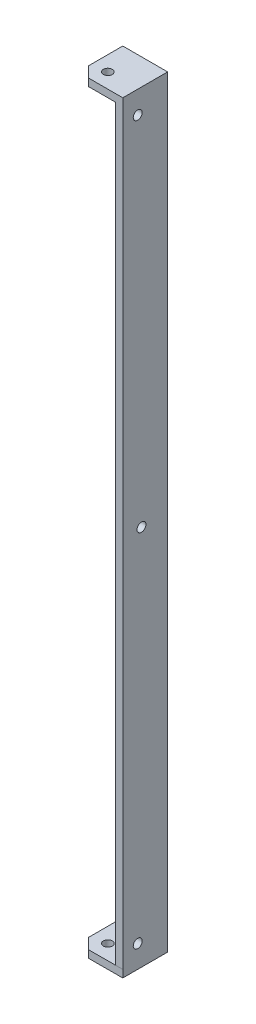
ISO-10303-21;
HEADER;
FILE_DESCRIPTION(('STEP AP214'),'2;1');
FILE_NAME('part.step','',(''),(''),'','','');
FILE_SCHEMA(('AUTOMOTIVE_DESIGN { 1 0 10303 214 1 1 1 1 }'));
ENDSEC;
DATA;
#1=APPLICATION_CONTEXT('core data for automotive mechanical design processes');
#2=APPLICATION_PROTOCOL_DEFINITION('international standard','automotive_design',2000,#1);
#3=PRODUCT_CONTEXT('',#1,'mechanical');
#4=PRODUCT('Part','Part','',(#3));
#5=PRODUCT_RELATED_PRODUCT_CATEGORY('part','',(#4));
#6=PRODUCT_DEFINITION_FORMATION('','',#4);
#7=PRODUCT_DEFINITION_CONTEXT('part definition',#1,'design');
#8=PRODUCT_DEFINITION('design','',#6,#7);
#9=PRODUCT_DEFINITION_SHAPE('','',#8);
#10=(LENGTH_UNIT() NAMED_UNIT(*) SI_UNIT(.MILLI.,.METRE.));
#11=(NAMED_UNIT(*) PLANE_ANGLE_UNIT() SI_UNIT($,.RADIAN.));
#12=(NAMED_UNIT(*) SI_UNIT($,.STERADIAN.) SOLID_ANGLE_UNIT());
#13=UNCERTAINTY_MEASURE_WITH_UNIT(LENGTH_MEASURE(1.E-05),#10,'distance_accuracy_value','');
#14=(GEOMETRIC_REPRESENTATION_CONTEXT(3) GLOBAL_UNCERTAINTY_ASSIGNED_CONTEXT((#13)) GLOBAL_UNIT_ASSIGNED_CONTEXT((#10,
#11,#12)) REPRESENTATION_CONTEXT('',''));
#15=CARTESIAN_POINT('',(0.,0.,0.));
#16=DIRECTION('',(0.,0.,1.));
#17=DIRECTION('',(1.,0.,0.));
#18=AXIS2_PLACEMENT_3D('',#15,#16,#17);
#19=CARTESIAN_POINT('',(0.,0.,5.));
#20=DIRECTION('',(0.,0.,-1.));
#21=DIRECTION('',(-1.,0.,0.));
#22=AXIS2_PLACEMENT_3D('',#19,#20,#21);
#23=PLANE('',#22);
#24=DIRECTION('',(0.,1.,0.));
#25=VECTOR('',#24,1.);
#26=CARTESIAN_POINT('',(12.5,-250.,5.));
#27=LINE('',#26,#25);
#28=CARTESIAN_POINT('',(12.5,-250.,5.));
#29=VERTEX_POINT('',#28);
#30=CARTESIAN_POINT('',(12.5,250.,5.));
#31=VERTEX_POINT('',#30);
#32=EDGE_CURVE('E225',#29,#31,#27,.T.);
#33=ORIENTED_EDGE('',*,*,#32,.T.);
#34=DIRECTION('',(-1.,0.,0.));
#35=VECTOR('',#34,1.);
#36=CARTESIAN_POINT('',(-12.5,250.,5.));
#37=LINE('',#36,#35);
#38=CARTESIAN_POINT('',(-12.5000000000001,250.,5.));
#39=VERTEX_POINT('',#38);
#40=EDGE_CURVE('E52',#31,#39,#37,.T.);
#41=ORIENTED_EDGE('',*,*,#40,.T.);
#42=DIRECTION('',(0.,-1.,0.));
#43=VECTOR('',#42,1.);
#44=CARTESIAN_POINT('',(-12.5,-250.,5.));
#45=LINE('',#44,#43);
#46=CARTESIAN_POINT('',(-12.5,-250.,5.00000000000001));
#47=VERTEX_POINT('',#46);
#48=EDGE_CURVE('E44',#39,#47,#45,.T.);
#49=ORIENTED_EDGE('',*,*,#48,.T.);
#50=DIRECTION('',(1.,0.,0.));
#51=VECTOR('',#50,1.);
#52=CARTESIAN_POINT('',(-12.5,-250.,5.));
#53=LINE('',#52,#51);
#54=EDGE_CURVE('E11',#47,#29,#53,.T.);
#55=ORIENTED_EDGE('',*,*,#54,.T.);
#56=EDGE_LOOP('',(#33,#41,#49,#55));
#57=FACE_BOUND('',#56,.T.);
#58=CARTESIAN_POINT('',(-2.5,240.,5.));
#59=DIRECTION('',(0.,0.,1.));
#60=DIRECTION('',(1.,0.,0.));
#61=AXIS2_PLACEMENT_3D('',#58,#59,#60);
#62=CIRCLE('',#61,3.);
#63=CARTESIAN_POINT('',(0.500000000000001,240.,5.));
#64=VERTEX_POINT('',#63);
#65=EDGE_CURVE('E219',#64,#64,#62,.T.);
#66=ORIENTED_EDGE('',*,*,#65,.F.);
#67=EDGE_LOOP('',(#66));
#68=FACE_BOUND('',#67,.T.);
#69=CARTESIAN_POINT('',(-2.5,-240.,5.));
#70=DIRECTION('',(0.,0.,1.));
#71=DIRECTION('',(1.,0.,0.));
#72=AXIS2_PLACEMENT_3D('',#69,#70,#71);
#73=CIRCLE('',#72,3.);
#74=CARTESIAN_POINT('',(0.500000000000001,-240.,5.));
#75=VERTEX_POINT('',#74);
#76=EDGE_CURVE('E213',#75,#75,#73,.T.);
#77=ORIENTED_EDGE('',*,*,#76,.F.);
#78=EDGE_LOOP('',(#77));
#79=FACE_BOUND('',#78,.T.);
#80=CARTESIAN_POINT('',(0.,0.,5.));
#81=DIRECTION('',(0.,0.,1.));
#82=DIRECTION('',(1.,0.,0.));
#83=AXIS2_PLACEMENT_3D('',#80,#81,#82);
#84=CIRCLE('',#83,3.);
#85=CARTESIAN_POINT('',(3.,0.,5.));
#86=VERTEX_POINT('',#85);
#87=EDGE_CURVE('E207',#86,#86,#84,.T.);
#88=ORIENTED_EDGE('',*,*,#87,.F.);
#89=EDGE_LOOP('',(#88));
#90=FACE_BOUND('',#89,.T.);
#91=ADVANCED_FACE('F35',(#57,#68,#79,#90),#23,.F.);
#92=CARTESIAN_POINT('',(0.,0.,0.));
#93=DIRECTION('',(0.,0.,-1.));
#94=DIRECTION('',(-1.,0.,0.));
#95=AXIS2_PLACEMENT_3D('',#92,#93,#94);
#96=PLANE('',#95);
#97=CARTESIAN_POINT('',(-2.5,-240.,0.));
#98=DIRECTION('',(0.,0.,1.));
#99=DIRECTION('',(1.,0.,0.));
#100=AXIS2_PLACEMENT_3D('',#97,#98,#99);
#101=CIRCLE('',#100,3.);
#102=CARTESIAN_POINT('',(0.500000000000001,-240.,0.));
#103=VERTEX_POINT('',#102);
#104=EDGE_CURVE('E210',#103,#103,#101,.T.);
#105=ORIENTED_EDGE('',*,*,#104,.T.);
#106=EDGE_LOOP('',(#105));
#107=FACE_BOUND('',#106,.T.);
#108=DIRECTION('',(0.,-1.,0.));
#109=VECTOR('',#108,1.);
#110=CARTESIAN_POINT('',(-12.5,-250.,0.));
#111=LINE('',#110,#109);
#112=CARTESIAN_POINT('',(-12.5,255.,0.));
#113=VERTEX_POINT('',#112);
#114=CARTESIAN_POINT('',(-12.5,-255.,0.));
#115=VERTEX_POINT('',#114);
#116=EDGE_CURVE('E222',#113,#115,#111,.T.);
#117=ORIENTED_EDGE('',*,*,#116,.F.);
#118=DIRECTION('',(-1.,0.,0.));
#119=VECTOR('',#118,1.);
#120=CARTESIAN_POINT('',(-12.5,255.,0.));
#121=LINE('',#120,#119);
#122=CARTESIAN_POINT('',(17.5,255.,0.));
#123=VERTEX_POINT('',#122);
#124=EDGE_CURVE('E166',#123,#113,#121,.T.);
#125=ORIENTED_EDGE('',*,*,#124,.F.);
#126=DIRECTION('',(0.,-1.,0.));
#127=VECTOR('',#126,1.);
#128=CARTESIAN_POINT('',(17.5,250.,0.));
#129=LINE('',#128,#127);
#130=CARTESIAN_POINT('',(17.5,-255.,0.));
#131=VERTEX_POINT('',#130);
#132=EDGE_CURVE('E197',#123,#131,#129,.T.);
#133=ORIENTED_EDGE('',*,*,#132,.T.);
#134=DIRECTION('',(1.,0.,0.));
#135=VECTOR('',#134,1.);
#136=CARTESIAN_POINT('',(-12.5,-255.,0.));
#137=LINE('',#136,#135);
#138=EDGE_CURVE('E262',#115,#131,#137,.T.);
#139=ORIENTED_EDGE('',*,*,#138,.F.);
#140=EDGE_LOOP('',(#117,#125,#133,#139));
#141=FACE_BOUND('',#140,.T.);
#142=CARTESIAN_POINT('',(-2.5,240.,0.));
#143=DIRECTION('',(0.,0.,1.));
#144=DIRECTION('',(1.,0.,0.));
#145=AXIS2_PLACEMENT_3D('',#142,#143,#144);
#146=CIRCLE('',#145,3.);
#147=CARTESIAN_POINT('',(0.500000000000001,240.,0.));
#148=VERTEX_POINT('',#147);
#149=EDGE_CURVE('E216',#148,#148,#146,.T.);
#150=ORIENTED_EDGE('',*,*,#149,.T.);
#151=EDGE_LOOP('',(#150));
#152=FACE_BOUND('',#151,.T.);
#153=CARTESIAN_POINT('',(0.,0.,0.));
#154=DIRECTION('',(0.,0.,1.));
#155=DIRECTION('',(1.,0.,0.));
#156=AXIS2_PLACEMENT_3D('',#153,#154,#155);
#157=CIRCLE('',#156,3.);
#158=CARTESIAN_POINT('',(3.,0.,0.));
#159=VERTEX_POINT('',#158);
#160=EDGE_CURVE('E205',#159,#159,#157,.T.);
#161=ORIENTED_EDGE('',*,*,#160,.T.);
#162=EDGE_LOOP('',(#161));
#163=FACE_BOUND('',#162,.T.);
#164=ADVANCED_FACE('F260',(#107,#141,#152,#163),#96,.T.);
#165=CARTESIAN_POINT('',(-12.5,-250.,5.));
#166=DIRECTION('',(1.,0.,0.));
#167=DIRECTION('',(0.,0.,-1.));
#168=AXIS2_PLACEMENT_3D('',#165,#166,#167);
#169=PLANE('',#168);
#170=ORIENTED_EDGE('',*,*,#116,.T.);
#171=DIRECTION('',(0.,0.,-1.));
#172=VECTOR('',#171,1.);
#173=CARTESIAN_POINT('',(-12.5,-255.,22.9563784697419));
#174=LINE('',#173,#172);
#175=CARTESIAN_POINT('',(-12.5,-255.,22.9563784697419));
#176=VERTEX_POINT('',#175);
#177=EDGE_CURVE('E128',#176,#115,#174,.T.);
#178=ORIENTED_EDGE('',*,*,#177,.F.);
#179=DIRECTION('',(0.,1.,0.));
#180=VECTOR('',#179,1.);
#181=CARTESIAN_POINT('',(-12.5,-255.,22.9563784697419));
#182=LINE('',#181,#180);
#183=CARTESIAN_POINT('',(-12.5,-250.,22.9563784697419));
#184=VERTEX_POINT('',#183);
#185=EDGE_CURVE('E124',#176,#184,#182,.T.);
#186=ORIENTED_EDGE('',*,*,#185,.T.);
#187=DIRECTION('',(0.,0.,-1.));
#188=VECTOR('',#187,1.);
#189=CARTESIAN_POINT('',(-12.5,-250.,22.9563784697419));
#190=LINE('',#189,#188);
#191=EDGE_CURVE('E139',#184,#47,#190,.T.);
#192=ORIENTED_EDGE('',*,*,#191,.T.);
#193=ORIENTED_EDGE('',*,*,#48,.F.);
#194=DIRECTION('',(0.,0.,1.));
#195=VECTOR('',#194,1.);
#196=CARTESIAN_POINT('',(-12.5000000000001,250.,22.9289321881345));
#197=LINE('',#196,#195);
#198=CARTESIAN_POINT('',(-12.5000000000001,250.,22.9289321881345));
#199=VERTEX_POINT('',#198);
#200=EDGE_CURVE('E160',#39,#199,#197,.T.);
#201=ORIENTED_EDGE('',*,*,#200,.T.);
#202=DIRECTION('',(0.,-1.,0.));
#203=VECTOR('',#202,1.);
#204=CARTESIAN_POINT('',(-12.5,255.,22.9289321881345));
#205=LINE('',#204,#203);
#206=CARTESIAN_POINT('',(-12.5,255.,22.9289321881345));
#207=VERTEX_POINT('',#206);
#208=EDGE_CURVE('E171',#207,#199,#205,.T.);
#209=ORIENTED_EDGE('',*,*,#208,.F.);
#210=DIRECTION('',(0.,0.,1.));
#211=VECTOR('',#210,1.);
#212=CARTESIAN_POINT('',(-12.5,255.,22.9289321881345));
#213=LINE('',#212,#211);
#214=EDGE_CURVE('E169',#113,#207,#213,.T.);
#215=ORIENTED_EDGE('',*,*,#214,.F.);
#216=EDGE_LOOP('',(#170,#178,#186,#192,#193,#201,#209,#215));
#217=FACE_BOUND('',#216,.T.);
#218=ADVANCED_FACE('F37',(#217),#169,.F.);
#219=CARTESIAN_POINT('',(-2.5,240.,5.));
#220=DIRECTION('',(0.,0.,-1.));
#221=DIRECTION('',(-1.,0.,0.));
#222=AXIS2_PLACEMENT_3D('',#219,#220,#221);
#223=CYLINDRICAL_SURFACE('',#222,3.);
#224=ORIENTED_EDGE('',*,*,#65,.T.);
#225=EDGE_LOOP('',(#224));
#226=FACE_BOUND('',#225,.T.);
#227=ORIENTED_EDGE('',*,*,#149,.F.);
#228=EDGE_LOOP('',(#227));
#229=FACE_BOUND('',#228,.T.);
#230=ADVANCED_FACE('F314',(#226,#229),#223,.F.);
#231=CARTESIAN_POINT('',(-2.5,-240.,5.));
#232=DIRECTION('',(0.,0.,-1.));
#233=DIRECTION('',(-1.,0.,0.));
#234=AXIS2_PLACEMENT_3D('',#231,#232,#233);
#235=CYLINDRICAL_SURFACE('',#234,3.);
#236=ORIENTED_EDGE('',*,*,#76,.T.);
#237=EDGE_LOOP('',(#236));
#238=FACE_BOUND('',#237,.T.);
#239=ORIENTED_EDGE('',*,*,#104,.F.);
#240=EDGE_LOOP('',(#239));
#241=FACE_BOUND('',#240,.T.);
#242=ADVANCED_FACE('F317',(#238,#241),#235,.F.);
#243=CARTESIAN_POINT('',(0.,0.,5.));
#244=DIRECTION('',(0.,0.,-1.));
#245=DIRECTION('',(-1.,0.,0.));
#246=AXIS2_PLACEMENT_3D('',#243,#244,#245);
#247=CYLINDRICAL_SURFACE('',#246,3.);
#248=ORIENTED_EDGE('',*,*,#87,.T.);
#249=EDGE_LOOP('',(#248));
#250=FACE_BOUND('',#249,.T.);
#251=ORIENTED_EDGE('',*,*,#160,.F.);
#252=EDGE_LOOP('',(#251));
#253=FACE_BOUND('',#252,.T.);
#254=ADVANCED_FACE('F321',(#250,#253),#247,.F.);
#255=CARTESIAN_POINT('',(12.5,250.,30.));
#256=DIRECTION('',(-1.,0.,0.));
#257=DIRECTION('',(0.,-1.,0.));
#258=AXIS2_PLACEMENT_3D('',#255,#256,#257);
#259=PLANE('',#258);
#260=CARTESIAN_POINT('',(12.5,-240.,20.));
#261=DIRECTION('',(-1.,0.,0.));
#262=DIRECTION('',(0.,0.,1.));
#263=AXIS2_PLACEMENT_3D('',#260,#261,#262);
#264=CIRCLE('',#263,3.);
#265=CARTESIAN_POINT('',(12.5,-240.,23.0000000000001));
#266=VERTEX_POINT('',#265);
#267=EDGE_CURVE('E184',#266,#266,#264,.T.);
#268=ORIENTED_EDGE('',*,*,#267,.F.);
#269=EDGE_LOOP('',(#268));
#270=FACE_BOUND('',#269,.T.);
#271=CARTESIAN_POINT('',(12.5,0.,17.5));
#272=DIRECTION('',(-1.,0.,0.));
#273=DIRECTION('',(0.,0.,1.));
#274=AXIS2_PLACEMENT_3D('',#271,#272,#273);
#275=CIRCLE('',#274,3.);
#276=CARTESIAN_POINT('',(12.5,0.,20.5));
#277=VERTEX_POINT('',#276);
#278=EDGE_CURVE('E188',#277,#277,#275,.T.);
#279=ORIENTED_EDGE('',*,*,#278,.F.);
#280=EDGE_LOOP('',(#279));
#281=FACE_BOUND('',#280,.T.);
#282=CARTESIAN_POINT('',(12.5,240.,20.));
#283=DIRECTION('',(-1.,0.,0.));
#284=DIRECTION('',(0.,0.,1.));
#285=AXIS2_PLACEMENT_3D('',#282,#283,#284);
#286=CIRCLE('',#285,3.);
#287=CARTESIAN_POINT('',(12.5,240.,23.));
#288=VERTEX_POINT('',#287);
#289=EDGE_CURVE('E183',#288,#288,#286,.T.);
#290=ORIENTED_EDGE('',*,*,#289,.F.);
#291=EDGE_LOOP('',(#290));
#292=FACE_BOUND('',#291,.T.);
#293=ORIENTED_EDGE('',*,*,#32,.F.);
#294=DIRECTION('',(0.,0.,-1.));
#295=VECTOR('',#294,1.);
#296=CARTESIAN_POINT('',(12.5,-250.,30.));
#297=LINE('',#296,#295);
#298=CARTESIAN_POINT('',(12.5,-250.,30.));
#299=VERTEX_POINT('',#298);
#300=EDGE_CURVE('E60',#299,#29,#297,.T.);
#301=ORIENTED_EDGE('',*,*,#300,.F.);
#302=DIRECTION('',(0.,1.,0.));
#303=VECTOR('',#302,1.);
#304=CARTESIAN_POINT('',(12.5,250.,30.));
#305=LINE('',#304,#303);
#306=CARTESIAN_POINT('',(12.5,250.,30.));
#307=VERTEX_POINT('',#306);
#308=EDGE_CURVE('E193',#299,#307,#305,.T.);
#309=ORIENTED_EDGE('',*,*,#308,.T.);
#310=DIRECTION('',(0.,0.,-1.));
#311=VECTOR('',#310,1.);
#312=CARTESIAN_POINT('',(12.5,250.,30.));
#313=LINE('',#312,#311);
#314=EDGE_CURVE('E202',#307,#31,#313,.T.);
#315=ORIENTED_EDGE('',*,*,#314,.T.);
#316=EDGE_LOOP('',(#293,#301,#309,#315));
#317=FACE_BOUND('',#316,.T.);
#318=ADVANCED_FACE('F247',(#270,#281,#292,#317),#259,.T.);
#319=CARTESIAN_POINT('',(17.5,250.,30.));
#320=DIRECTION('',(1.,0.,0.));
#321=DIRECTION('',(0.,0.,-1.));
#322=AXIS2_PLACEMENT_3D('',#319,#320,#321);
#323=PLANE('',#322);
#324=CARTESIAN_POINT('',(17.5,-240.,20.));
#325=DIRECTION('',(1.,0.,0.));
#326=DIRECTION('',(0.,0.,-1.));
#327=AXIS2_PLACEMENT_3D('',#324,#325,#326);
#328=CIRCLE('',#327,3.);
#329=CARTESIAN_POINT('',(17.5,-240.,17.));
#330=VERTEX_POINT('',#329);
#331=EDGE_CURVE('E39',#330,#330,#328,.T.);
#332=ORIENTED_EDGE('',*,*,#331,.F.);
#333=EDGE_LOOP('',(#332));
#334=FACE_BOUND('',#333,.T.);
#335=CARTESIAN_POINT('',(17.5,0.,17.5));
#336=DIRECTION('',(1.,0.,0.));
#337=DIRECTION('',(0.,0.,-1.));
#338=AXIS2_PLACEMENT_3D('',#335,#336,#337);
#339=CIRCLE('',#338,3.);
#340=CARTESIAN_POINT('',(17.5,0.,14.5));
#341=VERTEX_POINT('',#340);
#342=EDGE_CURVE('E233',#341,#341,#339,.T.);
#343=ORIENTED_EDGE('',*,*,#342,.F.);
#344=EDGE_LOOP('',(#343));
#345=FACE_BOUND('',#344,.T.);
#346=CARTESIAN_POINT('',(17.5,240.,20.));
#347=DIRECTION('',(1.,0.,0.));
#348=DIRECTION('',(0.,0.,-1.));
#349=AXIS2_PLACEMENT_3D('',#346,#347,#348);
#350=CIRCLE('',#349,3.);
#351=CARTESIAN_POINT('',(17.5,240.,17.));
#352=VERTEX_POINT('',#351);
#353=EDGE_CURVE('E187',#352,#352,#350,.T.);
#354=ORIENTED_EDGE('',*,*,#353,.F.);
#355=EDGE_LOOP('',(#354));
#356=FACE_BOUND('',#355,.T.);
#357=ORIENTED_EDGE('',*,*,#132,.F.);
#358=DIRECTION('',(0.,0.,-1.));
#359=VECTOR('',#358,1.);
#360=CARTESIAN_POINT('',(17.5,255.,30.));
#361=LINE('',#360,#359);
#362=CARTESIAN_POINT('',(17.5,255.,30.));
#363=VERTEX_POINT('',#362);
#364=EDGE_CURVE('E163',#363,#123,#361,.T.);
#365=ORIENTED_EDGE('',*,*,#364,.F.);
#366=DIRECTION('',(0.,-1.,0.));
#367=VECTOR('',#366,1.);
#368=CARTESIAN_POINT('',(17.5,250.,30.));
#369=LINE('',#368,#367);
#370=CARTESIAN_POINT('',(17.5,-250.,30.));
#371=VERTEX_POINT('',#370);
#372=EDGE_CURVE('E196',#363,#371,#369,.T.);
#373=ORIENTED_EDGE('',*,*,#372,.T.);
#374=DIRECTION('',(0.,1.,0.));
#375=VECTOR('',#374,1.);
#376=CARTESIAN_POINT('',(17.5,-255.,30.));
#377=LINE('',#376,#375);
#378=CARTESIAN_POINT('',(17.5,-255.,30.));
#379=VERTEX_POINT('',#378);
#380=EDGE_CURVE('E149',#379,#371,#377,.T.);
#381=ORIENTED_EDGE('',*,*,#380,.F.);
#382=DIRECTION('',(0.,0.,1.));
#383=VECTOR('',#382,1.);
#384=CARTESIAN_POINT('',(17.5,-255.,0.));
#385=LINE('',#384,#383);
#386=EDGE_CURVE('E136',#131,#379,#385,.T.);
#387=ORIENTED_EDGE('',*,*,#386,.F.);
#388=EDGE_LOOP('',(#357,#365,#373,#381,#387));
#389=FACE_BOUND('',#388,.T.);
#390=ADVANCED_FACE('F243',(#334,#345,#356,#389),#323,.T.);
#391=CARTESIAN_POINT('',(0.,0.,30.));
#392=DIRECTION('',(0.,0.,1.));
#393=DIRECTION('',(1.,0.,0.));
#394=AXIS2_PLACEMENT_3D('',#391,#392,#393);
#395=PLANE('',#394);
#396=ORIENTED_EDGE('',*,*,#308,.F.);
#397=DIRECTION('',(-1.,0.,0.));
#398=VECTOR('',#397,1.);
#399=CARTESIAN_POINT('',(12.5,-250.,30.));
#400=LINE('',#399,#398);
#401=EDGE_CURVE('E200',#371,#299,#400,.T.);
#402=ORIENTED_EDGE('',*,*,#401,.F.);
#403=ORIENTED_EDGE('',*,*,#372,.F.);
#404=DIRECTION('',(1.,0.,0.));
#405=VECTOR('',#404,1.);
#406=CARTESIAN_POINT('',(-5.42893218813455,255.,30.));
#407=LINE('',#406,#405);
#408=CARTESIAN_POINT('',(-5.42893218813455,255.,30.));
#409=VERTEX_POINT('',#408);
#410=EDGE_CURVE('E159',#409,#363,#407,.T.);
#411=ORIENTED_EDGE('',*,*,#410,.F.);
#412=DIRECTION('',(0.,-1.,0.));
#413=VECTOR('',#412,1.);
#414=CARTESIAN_POINT('',(-5.42893218813455,255.,30.));
#415=LINE('',#414,#413);
#416=CARTESIAN_POINT('',(-5.42893218813455,250.,30.));
#417=VERTEX_POINT('',#416);
#418=EDGE_CURVE('E180',#409,#417,#415,.T.);
#419=ORIENTED_EDGE('',*,*,#418,.T.);
#420=DIRECTION('',(1.,0.,0.));
#421=VECTOR('',#420,1.);
#422=CARTESIAN_POINT('',(-5.42893218813455,250.,30.));
#423=LINE('',#422,#421);
#424=EDGE_CURVE('E174',#417,#307,#423,.T.);
#425=ORIENTED_EDGE('',*,*,#424,.T.);
#426=EDGE_LOOP('',(#396,#402,#403,#411,#419,#425));
#427=FACE_BOUND('',#426,.T.);
#428=ADVANCED_FACE('F246',(#427),#395,.T.);
#429=CARTESIAN_POINT('',(33.,240.,20.));
#430=DIRECTION('',(-1.,0.,0.));
#431=DIRECTION('',(0.,0.,1.));
#432=AXIS2_PLACEMENT_3D('',#429,#430,#431);
#433=CYLINDRICAL_SURFACE('',#432,3.);
#434=ORIENTED_EDGE('',*,*,#353,.T.);
#435=EDGE_LOOP('',(#434));
#436=FACE_BOUND('',#435,.T.);
#437=ORIENTED_EDGE('',*,*,#289,.T.);
#438=EDGE_LOOP('',(#437));
#439=FACE_BOUND('',#438,.T.);
#440=ADVANCED_FACE('F331',(#436,#439),#433,.F.);
#441=CARTESIAN_POINT('',(33.,0.,17.5));
#442=DIRECTION('',(-1.,0.,0.));
#443=DIRECTION('',(0.,0.,1.));
#444=AXIS2_PLACEMENT_3D('',#441,#442,#443);
#445=CYLINDRICAL_SURFACE('',#444,3.);
#446=ORIENTED_EDGE('',*,*,#342,.T.);
#447=EDGE_LOOP('',(#446));
#448=FACE_BOUND('',#447,.T.);
#449=ORIENTED_EDGE('',*,*,#278,.T.);
#450=EDGE_LOOP('',(#449));
#451=FACE_BOUND('',#450,.T.);
#452=ADVANCED_FACE('F334',(#448,#451),#445,.F.);
#453=CARTESIAN_POINT('',(33.,-240.,20.));
#454=DIRECTION('',(-1.,0.,0.));
#455=DIRECTION('',(0.,0.,1.));
#456=AXIS2_PLACEMENT_3D('',#453,#454,#455);
#457=CYLINDRICAL_SURFACE('',#456,3.);
#458=ORIENTED_EDGE('',*,*,#331,.T.);
#459=EDGE_LOOP('',(#458));
#460=FACE_BOUND('',#459,.T.);
#461=ORIENTED_EDGE('',*,*,#267,.T.);
#462=EDGE_LOOP('',(#461));
#463=FACE_BOUND('',#462,.T.);
#464=ADVANCED_FACE('F240',(#460,#463),#457,.F.);
#465=CARTESIAN_POINT('',(3.09565019140477E-13,255.,6.78681661440791E-13));
#466=DIRECTION('',(0.,1.,0.));
#467=DIRECTION('',(0.,0.,1.));
#468=AXIS2_PLACEMENT_3D('',#465,#466,#467);
#469=PLANE('',#468);
#470=DIRECTION('',(0.70710678118655,0.,0.707106781186545));
#471=VECTOR('',#470,1.);
#472=CARTESIAN_POINT('',(-12.5,255.,22.9289321881345));
#473=LINE('',#472,#471);
#474=EDGE_CURVE('E156',#207,#409,#473,.T.);
#475=ORIENTED_EDGE('',*,*,#474,.T.);
#476=ORIENTED_EDGE('',*,*,#410,.T.);
#477=ORIENTED_EDGE('',*,*,#364,.T.);
#478=ORIENTED_EDGE('',*,*,#124,.T.);
#479=ORIENTED_EDGE('',*,*,#214,.T.);
#480=EDGE_LOOP('',(#475,#476,#477,#478,#479));
#481=FACE_BOUND('',#480,.T.);
#482=CARTESIAN_POINT('',(-2.5,255.,20.));
#483=DIRECTION('',(0.,1.,0.));
#484=DIRECTION('',(-1.,0.,0.));
#485=AXIS2_PLACEMENT_3D('',#482,#483,#484);
#486=CIRCLE('',#485,3.);
#487=CARTESIAN_POINT('',(-5.5,255.,20.));
#488=VERTEX_POINT('',#487);
#489=EDGE_CURVE('E147',#488,#488,#486,.T.);
#490=ORIENTED_EDGE('',*,*,#489,.F.);
#491=EDGE_LOOP('',(#490));
#492=FACE_BOUND('',#491,.T.);
#493=ADVANCED_FACE('F257',(#481,#492),#469,.T.);
#494=CARTESIAN_POINT('',(3.0262612523657E-13,250.,6.78681661440791E-13));
#495=DIRECTION('',(0.,1.,0.));
#496=DIRECTION('',(0.,0.,1.));
#497=AXIS2_PLACEMENT_3D('',#494,#495,#496);
#498=PLANE('',#497);
#499=ORIENTED_EDGE('',*,*,#40,.F.);
#500=ORIENTED_EDGE('',*,*,#314,.F.);
#501=ORIENTED_EDGE('',*,*,#424,.F.);
#502=DIRECTION('',(0.70710678118655,0.,0.707106781186545));
#503=VECTOR('',#502,1.);
#504=CARTESIAN_POINT('',(-12.5000000000001,250.,22.9289321881345));
#505=LINE('',#504,#503);
#506=EDGE_CURVE('E154',#199,#417,#505,.T.);
#507=ORIENTED_EDGE('',*,*,#506,.F.);
#508=ORIENTED_EDGE('',*,*,#200,.F.);
#509=EDGE_LOOP('',(#499,#500,#501,#507,#508));
#510=FACE_BOUND('',#509,.T.);
#511=CARTESIAN_POINT('',(-2.50000000000001,250.,20.));
#512=DIRECTION('',(0.,1.,0.));
#513=DIRECTION('',(-1.,0.,0.));
#514=AXIS2_PLACEMENT_3D('',#511,#512,#513);
#515=CIRCLE('',#514,3.);
#516=CARTESIAN_POINT('',(-5.50000000000001,250.,20.));
#517=VERTEX_POINT('',#516);
#518=EDGE_CURVE('E144',#517,#517,#515,.T.);
#519=ORIENTED_EDGE('',*,*,#518,.T.);
#520=EDGE_LOOP('',(#519));
#521=FACE_BOUND('',#520,.T.);
#522=ADVANCED_FACE('F288',(#510,#521),#498,.F.);
#523=CARTESIAN_POINT('',(-12.5,255.,22.9289321881345));
#524=DIRECTION('',(0.707106781186545,0.,-0.70710678118655));
#525=DIRECTION('',(-0.70710678118655,0.,-0.707106781186545));
#526=AXIS2_PLACEMENT_3D('',#523,#524,#525);
#527=PLANE('',#526);
#528=ORIENTED_EDGE('',*,*,#506,.T.);
#529=ORIENTED_EDGE('',*,*,#418,.F.);
#530=ORIENTED_EDGE('',*,*,#474,.F.);
#531=ORIENTED_EDGE('',*,*,#208,.T.);
#532=EDGE_LOOP('',(#528,#529,#530,#531));
#533=FACE_BOUND('',#532,.T.);
#534=ADVANCED_FACE('F286',(#533),#527,.F.);
#535=CARTESIAN_POINT('',(-2.5,255.,20.));
#536=DIRECTION('',(0.,-1.,0.));
#537=DIRECTION('',(1.,0.,0.));
#538=AXIS2_PLACEMENT_3D('',#535,#536,#537);
#539=CYLINDRICAL_SURFACE('',#538,3.);
#540=ORIENTED_EDGE('',*,*,#489,.T.);
#541=EDGE_LOOP('',(#540));
#542=FACE_BOUND('',#541,.T.);
#543=ORIENTED_EDGE('',*,*,#518,.F.);
#544=EDGE_LOOP('',(#543));
#545=FACE_BOUND('',#544,.T.);
#546=ADVANCED_FACE('F294',(#542,#545),#539,.F.);
#547=CARTESIAN_POINT('',(0.,-250.,0.));
#548=DIRECTION('',(0.,-1.,0.));
#549=DIRECTION('',(0.,0.,-1.));
#550=AXIS2_PLACEMENT_3D('',#547,#548,#549);
#551=PLANE('',#550);
#552=CARTESIAN_POINT('',(-2.50000000000005,-250.,20.));
#553=DIRECTION('',(0.,-1.,0.));
#554=DIRECTION('',(0.,0.,-1.));
#555=AXIS2_PLACEMENT_3D('',#552,#553,#554);
#556=CIRCLE('',#555,3.);
#557=CARTESIAN_POINT('',(-2.50000000000005,-250.,17.));
#558=VERTEX_POINT('',#557);
#559=EDGE_CURVE('E451',#558,#558,#556,.T.);
#560=ORIENTED_EDGE('',*,*,#559,.T.);
#561=EDGE_LOOP('',(#560));
#562=FACE_BOUND('',#561,.T.);
#563=DIRECTION('',(-0.999997158920362,0.,0.0023837263273595));
#564=VECTOR('',#563,1.);
#565=CARTESIAN_POINT('',(17.5,-250.,30.));
#566=LINE('',#565,#564);
#567=CARTESIAN_POINT('',(-5.45631324884251,-250.,30.0547217237392));
#568=VERTEX_POINT('',#567);
#569=EDGE_CURVE('E143',#371,#568,#566,.T.);
#570=ORIENTED_EDGE('',*,*,#569,.F.);
#571=ORIENTED_EDGE('',*,*,#401,.T.);
#572=ORIENTED_EDGE('',*,*,#300,.T.);
#573=ORIENTED_EDGE('',*,*,#54,.F.);
#574=ORIENTED_EDGE('',*,*,#191,.F.);
#575=DIRECTION('',(-0.704368675115749,0.,-0.709834325399726));
#576=VECTOR('',#575,1.);
#577=CARTESIAN_POINT('',(-5.45631324884251,-250.,30.0547217237392));
#578=LINE('',#577,#576);
#579=EDGE_CURVE('E270',#568,#184,#578,.T.);
#580=ORIENTED_EDGE('',*,*,#579,.F.);
#581=EDGE_LOOP('',(#570,#571,#572,#573,#574,#580));
#582=FACE_BOUND('',#581,.T.);
#583=ADVANCED_FACE('F274',(#562,#582),#551,.F.);
#584=CARTESIAN_POINT('',(0.,-255.,0.));
#585=DIRECTION('',(0.,-1.,0.));
#586=DIRECTION('',(0.,0.,-1.));
#587=AXIS2_PLACEMENT_3D('',#584,#585,#586);
#588=PLANE('',#587);
#589=DIRECTION('',(-0.999997158920362,0.,0.0023837263273595));
#590=VECTOR('',#589,1.);
#591=CARTESIAN_POINT('',(17.5,-255.,30.));
#592=LINE('',#591,#590);
#593=CARTESIAN_POINT('',(-5.45631324884251,-255.,30.0547217237392));
#594=VERTEX_POINT('',#593);
#595=EDGE_CURVE('E129',#379,#594,#592,.T.);
#596=ORIENTED_EDGE('',*,*,#595,.T.);
#597=DIRECTION('',(-0.704368675115749,0.,-0.709834325399726));
#598=VECTOR('',#597,1.);
#599=CARTESIAN_POINT('',(-5.45631324884251,-255.,30.0547217237392));
#600=LINE('',#599,#598);
#601=EDGE_CURVE('E117',#594,#176,#600,.T.);
#602=ORIENTED_EDGE('',*,*,#601,.T.);
#603=ORIENTED_EDGE('',*,*,#177,.T.);
#604=ORIENTED_EDGE('',*,*,#138,.T.);
#605=ORIENTED_EDGE('',*,*,#386,.T.);
#606=EDGE_LOOP('',(#596,#602,#603,#604,#605));
#607=FACE_BOUND('',#606,.T.);
#608=CARTESIAN_POINT('',(-2.50000000000005,-255.,20.));
#609=DIRECTION('',(0.,-1.,0.));
#610=DIRECTION('',(0.,0.,-1.));
#611=AXIS2_PLACEMENT_3D('',#608,#609,#610);
#612=CIRCLE('',#611,3.);
#613=CARTESIAN_POINT('',(-2.50000000000005,-255.,17.));
#614=VERTEX_POINT('',#613);
#615=EDGE_CURVE('E271',#614,#614,#612,.T.);
#616=ORIENTED_EDGE('',*,*,#615,.F.);
#617=EDGE_LOOP('',(#616));
#618=FACE_BOUND('',#617,.T.);
#619=ADVANCED_FACE('F132',(#607,#618),#588,.T.);
#620=CARTESIAN_POINT('',(17.5,-255.,30.));
#621=DIRECTION('',(-0.0023837263273595,0.,-0.999997158920362));
#622=DIRECTION('',(-0.999997158920362,0.,0.0023837263273595));
#623=AXIS2_PLACEMENT_3D('',#620,#621,#622);
#624=PLANE('',#623);
#625=ORIENTED_EDGE('',*,*,#569,.T.);
#626=DIRECTION('',(0.,1.,0.));
#627=VECTOR('',#626,1.);
#628=CARTESIAN_POINT('',(-5.45631324884251,-255.,30.0547217237392));
#629=LINE('',#628,#627);
#630=EDGE_CURVE('E121',#594,#568,#629,.T.);
#631=ORIENTED_EDGE('',*,*,#630,.F.);
#632=ORIENTED_EDGE('',*,*,#595,.F.);
#633=ORIENTED_EDGE('',*,*,#380,.T.);
#634=EDGE_LOOP('',(#625,#631,#632,#633));
#635=FACE_BOUND('',#634,.T.);
#636=ADVANCED_FACE('F141',(#635),#624,.F.);
#637=CARTESIAN_POINT('',(-5.45631324884251,-255.,30.0547217237392));
#638=DIRECTION('',(0.709834325399726,0.,-0.704368675115749));
#639=DIRECTION('',(-0.704368675115749,0.,-0.709834325399727));
#640=AXIS2_PLACEMENT_3D('',#637,#638,#639);
#641=PLANE('',#640);
#642=ORIENTED_EDGE('',*,*,#579,.T.);
#643=ORIENTED_EDGE('',*,*,#185,.F.);
#644=ORIENTED_EDGE('',*,*,#601,.F.);
#645=ORIENTED_EDGE('',*,*,#630,.T.);
#646=EDGE_LOOP('',(#642,#643,#644,#645));
#647=FACE_BOUND('',#646,.T.);
#648=ADVANCED_FACE('F119',(#647),#641,.F.);
#649=CARTESIAN_POINT('',(-2.50000000000005,-255.,20.));
#650=DIRECTION('',(0.,1.,0.));
#651=DIRECTION('',(0.,0.,1.));
#652=AXIS2_PLACEMENT_3D('',#649,#650,#651);
#653=CYLINDRICAL_SURFACE('',#652,3.);
#654=ORIENTED_EDGE('',*,*,#615,.T.);
#655=EDGE_LOOP('',(#654));
#656=FACE_BOUND('',#655,.T.);
#657=ORIENTED_EDGE('',*,*,#559,.F.);
#658=EDGE_LOOP('',(#657));
#659=FACE_BOUND('',#658,.T.);
#660=ADVANCED_FACE('F433',(#656,#659),#653,.F.);
#661=CLOSED_SHELL('',(#91,#164,#218,#230,#242,#254,#318,#390,#428,#440,#452,#464,#493,#522,#534,
#546,#583,#619,#636,#648,#660));
#662=MANIFOLD_SOLID_BREP('B2',#661);
#663=ADVANCED_BREP_SHAPE_REPRESENTATION('',(#18,#662),#14);
#664=SHAPE_DEFINITION_REPRESENTATION(#9,#663);
ENDSEC;
END-ISO-10303-21;
